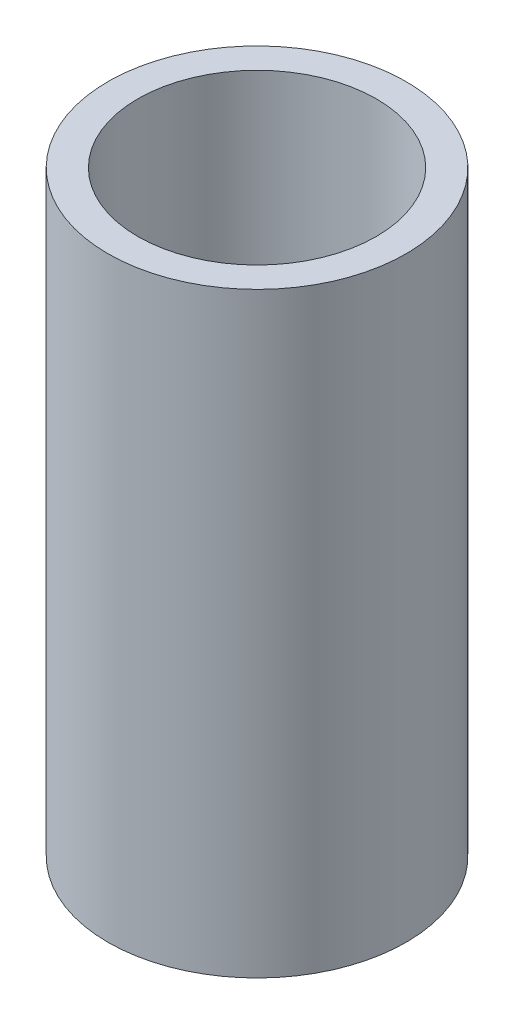
ISO-10303-21;
HEADER;
FILE_DESCRIPTION(('STEP AP214'),'2;1');
FILE_NAME('part.step','',(''),(''),'','','');
FILE_SCHEMA(('AUTOMOTIVE_DESIGN { 1 0 10303 214 1 1 1 1 }'));
ENDSEC;
DATA;
#1=APPLICATION_CONTEXT('core data for automotive mechanical design processes');
#2=APPLICATION_PROTOCOL_DEFINITION('international standard','automotive_design',2000,#1);
#3=PRODUCT_CONTEXT('',#1,'mechanical');
#4=PRODUCT('Part','Part','',(#3));
#5=PRODUCT_RELATED_PRODUCT_CATEGORY('part','',(#4));
#6=PRODUCT_DEFINITION_FORMATION('','',#4);
#7=PRODUCT_DEFINITION_CONTEXT('part definition',#1,'design');
#8=PRODUCT_DEFINITION('design','',#6,#7);
#9=PRODUCT_DEFINITION_SHAPE('','',#8);
#10=(LENGTH_UNIT() NAMED_UNIT(*) SI_UNIT(.MILLI.,.METRE.));
#11=(NAMED_UNIT(*) PLANE_ANGLE_UNIT() SI_UNIT($,.RADIAN.));
#12=(NAMED_UNIT(*) SI_UNIT($,.STERADIAN.) SOLID_ANGLE_UNIT());
#13=UNCERTAINTY_MEASURE_WITH_UNIT(LENGTH_MEASURE(1.E-05),#10,'distance_accuracy_value','');
#14=(GEOMETRIC_REPRESENTATION_CONTEXT(3) GLOBAL_UNCERTAINTY_ASSIGNED_CONTEXT((#13)) GLOBAL_UNIT_ASSIGNED_CONTEXT((#10,
#11,#12)) REPRESENTATION_CONTEXT('',''));
#15=CARTESIAN_POINT('',(0.,0.,0.));
#16=DIRECTION('',(0.,0.,1.));
#17=DIRECTION('',(1.,0.,0.));
#18=AXIS2_PLACEMENT_3D('',#15,#16,#17);
#19=CARTESIAN_POINT('',(0.,8.,0.));
#20=DIRECTION('',(0.,1.,0.));
#21=DIRECTION('',(0.,0.,1.));
#22=AXIS2_PLACEMENT_3D('',#19,#20,#21);
#23=PLANE('',#22);
#24=CARTESIAN_POINT('',(0.,8.,0.));
#25=DIRECTION('',(0.,1.,0.));
#26=DIRECTION('',(0.,0.,1.));
#27=AXIS2_PLACEMENT_3D('',#24,#25,#26);
#28=CIRCLE('',#27,2.);
#29=CARTESIAN_POINT('',(0.,8.,2.));
#30=VERTEX_POINT('',#29);
#31=EDGE_CURVE('E10',#30,#30,#28,.T.);
#32=ORIENTED_EDGE('',*,*,#31,.T.);
#33=EDGE_LOOP('',(#32));
#34=FACE_BOUND('',#33,.T.);
#35=CARTESIAN_POINT('',(0.,8.,0.));
#36=DIRECTION('',(0.,1.,0.));
#37=DIRECTION('',(0.,0.,1.));
#38=AXIS2_PLACEMENT_3D('',#35,#36,#37);
#39=CIRCLE('',#38,1.6);
#40=CARTESIAN_POINT('',(0.,8.,1.6));
#41=VERTEX_POINT('',#40);
#42=EDGE_CURVE('E42',#41,#41,#39,.T.);
#43=ORIENTED_EDGE('',*,*,#42,.F.);
#44=EDGE_LOOP('',(#43));
#45=FACE_BOUND('',#44,.T.);
#46=ADVANCED_FACE('F31',(#34,#45),#23,.T.);
#47=CARTESIAN_POINT('',(0.,0.,0.));
#48=DIRECTION('',(0.,1.,0.));
#49=DIRECTION('',(0.,0.,1.));
#50=AXIS2_PLACEMENT_3D('',#47,#48,#49);
#51=PLANE('',#50);
#52=CARTESIAN_POINT('',(0.,0.,0.));
#53=DIRECTION('',(0.,1.,0.));
#54=DIRECTION('',(0.,0.,1.));
#55=AXIS2_PLACEMENT_3D('',#52,#53,#54);
#56=CIRCLE('',#55,2.);
#57=CARTESIAN_POINT('',(0.,0.,2.));
#58=VERTEX_POINT('',#57);
#59=EDGE_CURVE('E35',#58,#58,#56,.T.);
#60=ORIENTED_EDGE('',*,*,#59,.F.);
#61=EDGE_LOOP('',(#60));
#62=FACE_BOUND('',#61,.T.);
#63=CARTESIAN_POINT('',(0.,0.,0.));
#64=DIRECTION('',(0.,1.,0.));
#65=DIRECTION('',(0.,0.,1.));
#66=AXIS2_PLACEMENT_3D('',#63,#64,#65);
#67=CIRCLE('',#66,1.6);
#68=CARTESIAN_POINT('',(0.,0.,1.6));
#69=VERTEX_POINT('',#68);
#70=EDGE_CURVE('E44',#69,#69,#67,.T.);
#71=ORIENTED_EDGE('',*,*,#70,.T.);
#72=EDGE_LOOP('',(#71));
#73=FACE_BOUND('',#72,.T.);
#74=ADVANCED_FACE('F54',(#62,#73),#51,.F.);
#75=CARTESIAN_POINT('',(0.,8.,0.));
#76=DIRECTION('',(0.,-1.,0.));
#77=DIRECTION('',(0.,0.,-1.));
#78=AXIS2_PLACEMENT_3D('',#75,#76,#77);
#79=CYLINDRICAL_SURFACE('',#78,2.);
#80=ORIENTED_EDGE('',*,*,#31,.F.);
#81=EDGE_LOOP('',(#80));
#82=FACE_BOUND('',#81,.T.);
#83=ORIENTED_EDGE('',*,*,#59,.T.);
#84=EDGE_LOOP('',(#83));
#85=FACE_BOUND('',#84,.T.);
#86=ADVANCED_FACE('F33',(#82,#85),#79,.T.);
#87=CARTESIAN_POINT('',(0.,8.,0.));
#88=DIRECTION('',(0.,-1.,0.));
#89=DIRECTION('',(0.,0.,-1.));
#90=AXIS2_PLACEMENT_3D('',#87,#88,#89);
#91=CYLINDRICAL_SURFACE('',#90,1.6);
#92=ORIENTED_EDGE('',*,*,#42,.T.);
#93=EDGE_LOOP('',(#92));
#94=FACE_BOUND('',#93,.T.);
#95=ORIENTED_EDGE('',*,*,#70,.F.);
#96=EDGE_LOOP('',(#95));
#97=FACE_BOUND('',#96,.T.);
#98=ADVANCED_FACE('F50',(#94,#97),#91,.F.);
#99=CLOSED_SHELL('',(#46,#74,#86,#98));
#100=MANIFOLD_SOLID_BREP('B2',#99);
#101=ADVANCED_BREP_SHAPE_REPRESENTATION('',(#18,#100),#14);
#102=SHAPE_DEFINITION_REPRESENTATION(#9,#101);
ENDSEC;
END-ISO-10303-21;
